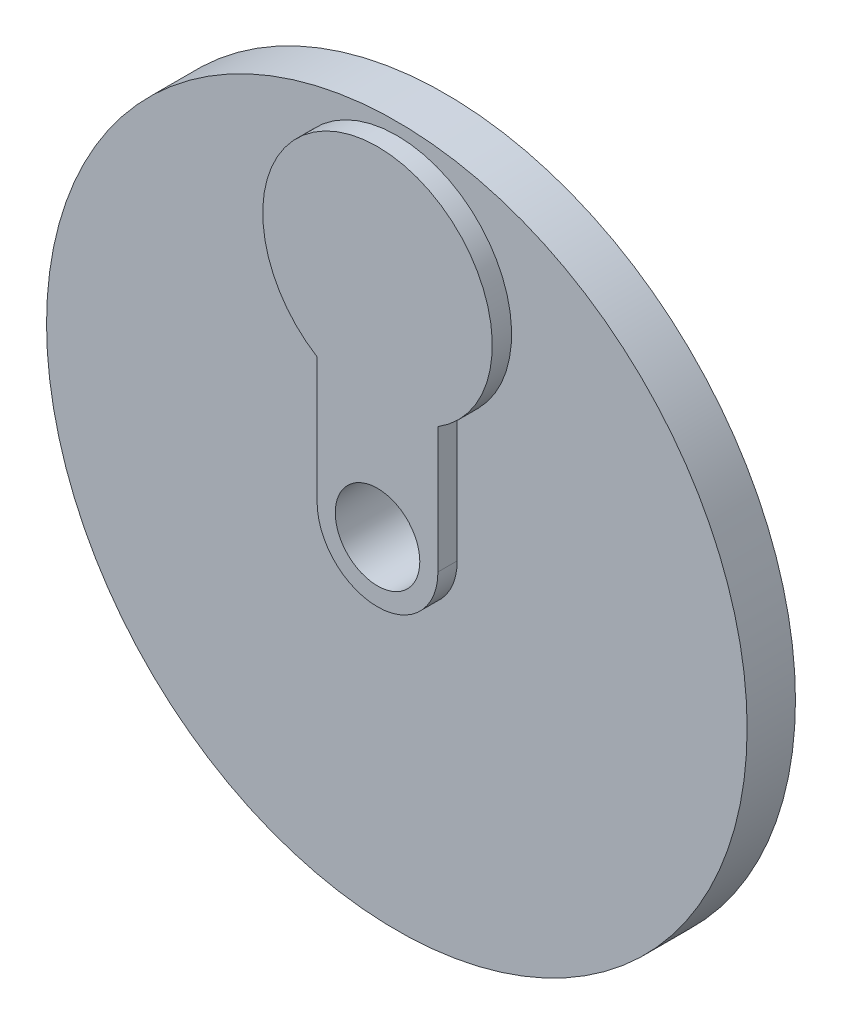
ISO-10303-21;
HEADER;
FILE_DESCRIPTION(('STEP AP214'),'2;1');
FILE_NAME('part.step','',(''),(''),'','','');
FILE_SCHEMA(('AUTOMOTIVE_DESIGN { 1 0 10303 214 1 1 1 1 }'));
ENDSEC;
DATA;
#1=APPLICATION_CONTEXT('core data for automotive mechanical design processes');
#2=APPLICATION_PROTOCOL_DEFINITION('international standard','automotive_design',2000,#1);
#3=PRODUCT_CONTEXT('',#1,'mechanical');
#4=PRODUCT('Part','Part','',(#3));
#5=PRODUCT_RELATED_PRODUCT_CATEGORY('part','',(#4));
#6=PRODUCT_DEFINITION_FORMATION('','',#4);
#7=PRODUCT_DEFINITION_CONTEXT('part definition',#1,'design');
#8=PRODUCT_DEFINITION('design','',#6,#7);
#9=PRODUCT_DEFINITION_SHAPE('','',#8);
#10=(LENGTH_UNIT() NAMED_UNIT(*) SI_UNIT(.MILLI.,.METRE.));
#11=(NAMED_UNIT(*) PLANE_ANGLE_UNIT() SI_UNIT($,.RADIAN.));
#12=(NAMED_UNIT(*) SI_UNIT($,.STERADIAN.) SOLID_ANGLE_UNIT());
#13=UNCERTAINTY_MEASURE_WITH_UNIT(LENGTH_MEASURE(1.E-05),#10,'distance_accuracy_value','');
#14=(GEOMETRIC_REPRESENTATION_CONTEXT(3) GLOBAL_UNCERTAINTY_ASSIGNED_CONTEXT((#13)) GLOBAL_UNIT_ASSIGNED_CONTEXT((#10,
#11,#12)) REPRESENTATION_CONTEXT('',''));
#15=CARTESIAN_POINT('',(0.,0.,0.));
#16=DIRECTION('',(0.,0.,1.));
#17=DIRECTION('',(1.,0.,0.));
#18=AXIS2_PLACEMENT_3D('',#15,#16,#17);
#19=CARTESIAN_POINT('',(0.,-9.25,2.));
#20=DIRECTION('',(0.,0.,1.));
#21=DIRECTION('',(1.,0.,0.));
#22=AXIS2_PLACEMENT_3D('',#19,#20,#21);
#23=PLANE('',#22);
#24=CARTESIAN_POINT('',(0.,-9.25,2.));
#25=DIRECTION('',(0.,0.,1.));
#26=DIRECTION('',(1.,0.,0.));
#27=AXIS2_PLACEMENT_3D('',#24,#25,#26);
#28=CIRCLE('',#27,14.5);
#29=CARTESIAN_POINT('',(14.5,-9.25,2.));
#30=VERTEX_POINT('',#29);
#31=EDGE_CURVE('E11',#30,#30,#28,.T.);
#32=ORIENTED_EDGE('',*,*,#31,.T.);
#33=EDGE_LOOP('',(#32));
#34=FACE_BOUND('',#33,.T.);
#35=DIRECTION('',(0.,1.,0.));
#36=VECTOR('',#35,1.);
#37=CARTESIAN_POINT('',(-2.5,-9.25,2.));
#38=LINE('',#37,#36);
#39=CARTESIAN_POINT('',(-2.5,-9.25,2.));
#40=VERTEX_POINT('',#39);
#41=CARTESIAN_POINT('',(-2.5,-4.03887360535088,2.));
#42=VERTEX_POINT('',#41);
#43=EDGE_CURVE('E104',#40,#42,#38,.T.);
#44=ORIENTED_EDGE('',*,*,#43,.T.);
#45=CARTESIAN_POINT('',(0.,0.,2.));
#46=DIRECTION('',(0.,0.,1.));
#47=DIRECTION('',(1.,0.,0.));
#48=AXIS2_PLACEMENT_3D('',#45,#46,#47);
#49=CIRCLE('',#48,4.75);
#50=CARTESIAN_POINT('',(2.5,-4.03887360535088,2.));
#51=VERTEX_POINT('',#50);
#52=EDGE_CURVE('E107',#51,#42,#49,.T.);
#53=ORIENTED_EDGE('',*,*,#52,.F.);
#54=DIRECTION('',(0.,1.,0.));
#55=VECTOR('',#54,1.);
#56=CARTESIAN_POINT('',(2.5,-9.25,2.));
#57=LINE('',#56,#55);
#58=CARTESIAN_POINT('',(2.5,-9.25,2.));
#59=VERTEX_POINT('',#58);
#60=EDGE_CURVE('E91',#59,#51,#57,.T.);
#61=ORIENTED_EDGE('',*,*,#60,.F.);
#62=CARTESIAN_POINT('',(0.,-9.25,2.));
#63=DIRECTION('',(0.,0.,1.));
#64=DIRECTION('',(1.,0.,0.));
#65=AXIS2_PLACEMENT_3D('',#62,#63,#64);
#66=CIRCLE('',#65,2.5);
#67=EDGE_CURVE('E99',#40,#59,#66,.T.);
#68=ORIENTED_EDGE('',*,*,#67,.F.);
#69=EDGE_LOOP('',(#44,#53,#61,#68));
#70=FACE_BOUND('',#69,.T.);
#71=ADVANCED_FACE('F35',(#34,#70),#23,.T.);
#72=CARTESIAN_POINT('',(0.,-9.25,2.));
#73=DIRECTION('',(0.,0.,-1.));
#74=DIRECTION('',(-1.,0.,0.));
#75=AXIS2_PLACEMENT_3D('',#72,#73,#74);
#76=CYLINDRICAL_SURFACE('',#75,14.5);
#77=ORIENTED_EDGE('',*,*,#31,.F.);
#78=EDGE_LOOP('',(#77));
#79=FACE_BOUND('',#78,.T.);
#80=CARTESIAN_POINT('',(0.,-9.25,0.));
#81=DIRECTION('',(0.,0.,1.));
#82=DIRECTION('',(1.,0.,0.));
#83=AXIS2_PLACEMENT_3D('',#80,#81,#82);
#84=CIRCLE('',#83,14.5);
#85=CARTESIAN_POINT('',(14.5,-9.25,0.));
#86=VERTEX_POINT('',#85);
#87=EDGE_CURVE('E39',#86,#86,#84,.T.);
#88=ORIENTED_EDGE('',*,*,#87,.T.);
#89=EDGE_LOOP('',(#88));
#90=FACE_BOUND('',#89,.T.);
#91=ADVANCED_FACE('F37',(#79,#90),#76,.T.);
#92=CARTESIAN_POINT('',(0.,-9.25,0.));
#93=DIRECTION('',(0.,0.,1.));
#94=DIRECTION('',(1.,0.,0.));
#95=AXIS2_PLACEMENT_3D('',#92,#93,#94);
#96=PLANE('',#95);
#97=CARTESIAN_POINT('',(0.,-9.25,0.));
#98=DIRECTION('',(0.,0.,1.));
#99=DIRECTION('',(1.,0.,0.));
#100=AXIS2_PLACEMENT_3D('',#97,#98,#99);
#101=CIRCLE('',#100,1.75);
#102=CARTESIAN_POINT('',(1.75,-9.25,0.));
#103=VERTEX_POINT('',#102);
#104=EDGE_CURVE('E143',#103,#103,#101,.T.);
#105=ORIENTED_EDGE('',*,*,#104,.T.);
#106=EDGE_LOOP('',(#105));
#107=FACE_BOUND('',#106,.T.);
#108=ORIENTED_EDGE('',*,*,#87,.F.);
#109=EDGE_LOOP('',(#108));
#110=FACE_BOUND('',#109,.T.);
#111=ADVANCED_FACE('F125',(#107,#110),#96,.F.);
#112=CARTESIAN_POINT('',(-2.5,-9.25,2.8));
#113=DIRECTION('',(-1.,0.,0.));
#114=DIRECTION('',(0.,0.,1.));
#115=AXIS2_PLACEMENT_3D('',#112,#113,#114);
#116=PLANE('',#115);
#117=ORIENTED_EDGE('',*,*,#43,.F.);
#118=DIRECTION('',(0.,0.,-1.));
#119=VECTOR('',#118,1.);
#120=CARTESIAN_POINT('',(-2.5,-9.25,2.8));
#121=LINE('',#120,#119);
#122=CARTESIAN_POINT('',(-2.5,-9.25,2.8));
#123=VERTEX_POINT('',#122);
#124=EDGE_CURVE('E59',#123,#40,#121,.T.);
#125=ORIENTED_EDGE('',*,*,#124,.F.);
#126=DIRECTION('',(0.,1.,0.));
#127=VECTOR('',#126,1.);
#128=CARTESIAN_POINT('',(-2.5,-9.25,2.8));
#129=LINE('',#128,#127);
#130=CARTESIAN_POINT('',(-2.5,-4.03887360535088,2.8));
#131=VERTEX_POINT('',#130);
#132=EDGE_CURVE('E97',#123,#131,#129,.T.);
#133=ORIENTED_EDGE('',*,*,#132,.T.);
#134=DIRECTION('',(0.,0.,-1.));
#135=VECTOR('',#134,1.);
#136=CARTESIAN_POINT('',(-2.5,-4.03887360535088,2.8));
#137=LINE('',#136,#135);
#138=EDGE_CURVE('E94',#131,#42,#137,.T.);
#139=ORIENTED_EDGE('',*,*,#138,.T.);
#140=EDGE_LOOP('',(#117,#125,#133,#139));
#141=FACE_BOUND('',#140,.T.);
#142=ADVANCED_FACE('F114',(#141),#116,.T.);
#143=CARTESIAN_POINT('',(0.,-9.25,2.8));
#144=DIRECTION('',(0.,0.,-1.));
#145=DIRECTION('',(-1.,0.,0.));
#146=AXIS2_PLACEMENT_3D('',#143,#144,#145);
#147=CYLINDRICAL_SURFACE('',#146,2.5);
#148=ORIENTED_EDGE('',*,*,#67,.T.);
#149=DIRECTION('',(0.,0.,-1.));
#150=VECTOR('',#149,1.);
#151=CARTESIAN_POINT('',(2.5,-9.25,2.8));
#152=LINE('',#151,#150);
#153=CARTESIAN_POINT('',(2.5,-9.25,2.8));
#154=VERTEX_POINT('',#153);
#155=EDGE_CURVE('E93',#154,#59,#152,.T.);
#156=ORIENTED_EDGE('',*,*,#155,.F.);
#157=CARTESIAN_POINT('',(0.,-9.25,2.8));
#158=DIRECTION('',(0.,0.,1.));
#159=DIRECTION('',(1.,0.,0.));
#160=AXIS2_PLACEMENT_3D('',#157,#158,#159);
#161=CIRCLE('',#160,2.5);
#162=EDGE_CURVE('E84',#123,#154,#161,.T.);
#163=ORIENTED_EDGE('',*,*,#162,.F.);
#164=ORIENTED_EDGE('',*,*,#124,.T.);
#165=EDGE_LOOP('',(#148,#156,#163,#164));
#166=FACE_BOUND('',#165,.T.);
#167=ADVANCED_FACE('F117',(#166),#147,.T.);
#168=CARTESIAN_POINT('',(2.5,-9.25,2.8));
#169=DIRECTION('',(-1.,0.,0.));
#170=DIRECTION('',(0.,-1.,0.));
#171=AXIS2_PLACEMENT_3D('',#168,#169,#170);
#172=PLANE('',#171);
#173=ORIENTED_EDGE('',*,*,#60,.T.);
#174=DIRECTION('',(0.,0.,-1.));
#175=VECTOR('',#174,1.);
#176=CARTESIAN_POINT('',(2.5,-4.03887360535088,2.8));
#177=LINE('',#176,#175);
#178=CARTESIAN_POINT('',(2.5,-4.03887360535088,2.8));
#179=VERTEX_POINT('',#178);
#180=EDGE_CURVE('E50',#179,#51,#177,.T.);
#181=ORIENTED_EDGE('',*,*,#180,.F.);
#182=DIRECTION('',(0.,1.,0.));
#183=VECTOR('',#182,1.);
#184=CARTESIAN_POINT('',(2.5,-9.25,2.8));
#185=LINE('',#184,#183);
#186=EDGE_CURVE('E82',#154,#179,#185,.T.);
#187=ORIENTED_EDGE('',*,*,#186,.F.);
#188=ORIENTED_EDGE('',*,*,#155,.T.);
#189=EDGE_LOOP('',(#173,#181,#187,#188));
#190=FACE_BOUND('',#189,.T.);
#191=ADVANCED_FACE('F89',(#190),#172,.F.);
#192=CARTESIAN_POINT('',(0.,0.,2.8));
#193=DIRECTION('',(0.,0.,-1.));
#194=DIRECTION('',(-1.,0.,0.));
#195=AXIS2_PLACEMENT_3D('',#192,#193,#194);
#196=CYLINDRICAL_SURFACE('',#195,4.75);
#197=ORIENTED_EDGE('',*,*,#52,.T.);
#198=ORIENTED_EDGE('',*,*,#138,.F.);
#199=CARTESIAN_POINT('',(0.,0.,2.8));
#200=DIRECTION('',(0.,0.,1.));
#201=DIRECTION('',(1.,0.,0.));
#202=AXIS2_PLACEMENT_3D('',#199,#200,#201);
#203=CIRCLE('',#202,4.75);
#204=EDGE_CURVE('E79',#179,#131,#203,.T.);
#205=ORIENTED_EDGE('',*,*,#204,.F.);
#206=ORIENTED_EDGE('',*,*,#180,.T.);
#207=EDGE_LOOP('',(#197,#198,#205,#206));
#208=FACE_BOUND('',#207,.T.);
#209=ADVANCED_FACE('F96',(#208),#196,.T.);
#210=CARTESIAN_POINT('',(0.,0.,2.8));
#211=DIRECTION('',(0.,0.,1.));
#212=DIRECTION('',(1.,0.,0.));
#213=AXIS2_PLACEMENT_3D('',#210,#211,#212);
#214=PLANE('',#213);
#215=CARTESIAN_POINT('',(0.,-9.25,2.8));
#216=DIRECTION('',(0.,0.,1.));
#217=DIRECTION('',(1.,0.,0.));
#218=AXIS2_PLACEMENT_3D('',#215,#216,#217);
#219=CIRCLE('',#218,1.75);
#220=CARTESIAN_POINT('',(1.75,-9.25,2.8));
#221=VERTEX_POINT('',#220);
#222=EDGE_CURVE('E108',#221,#221,#219,.T.);
#223=ORIENTED_EDGE('',*,*,#222,.F.);
#224=EDGE_LOOP('',(#223));
#225=FACE_BOUND('',#224,.T.);
#226=ORIENTED_EDGE('',*,*,#132,.F.);
#227=ORIENTED_EDGE('',*,*,#162,.T.);
#228=ORIENTED_EDGE('',*,*,#186,.T.);
#229=ORIENTED_EDGE('',*,*,#204,.T.);
#230=EDGE_LOOP('',(#226,#227,#228,#229));
#231=FACE_BOUND('',#230,.T.);
#232=ADVANCED_FACE('F83',(#225,#231),#214,.T.);
#233=CARTESIAN_POINT('',(0.,-9.25,2.8));
#234=DIRECTION('',(0.,0.,-1.));
#235=DIRECTION('',(-1.,0.,0.));
#236=AXIS2_PLACEMENT_3D('',#233,#234,#235);
#237=CYLINDRICAL_SURFACE('',#236,1.75);
#238=ORIENTED_EDGE('',*,*,#222,.T.);
#239=EDGE_LOOP('',(#238));
#240=FACE_BOUND('',#239,.T.);
#241=ORIENTED_EDGE('',*,*,#104,.F.);
#242=EDGE_LOOP('',(#241));
#243=FACE_BOUND('',#242,.T.);
#244=ADVANCED_FACE('F152',(#240,#243),#237,.F.);
#245=CLOSED_SHELL('',(#71,#91,#111,#142,#167,#191,#209,#232,#244));
#246=MANIFOLD_SOLID_BREP('B2',#245);
#247=ADVANCED_BREP_SHAPE_REPRESENTATION('',(#18,#246),#14);
#248=SHAPE_DEFINITION_REPRESENTATION(#9,#247);
ENDSEC;
END-ISO-10303-21;
